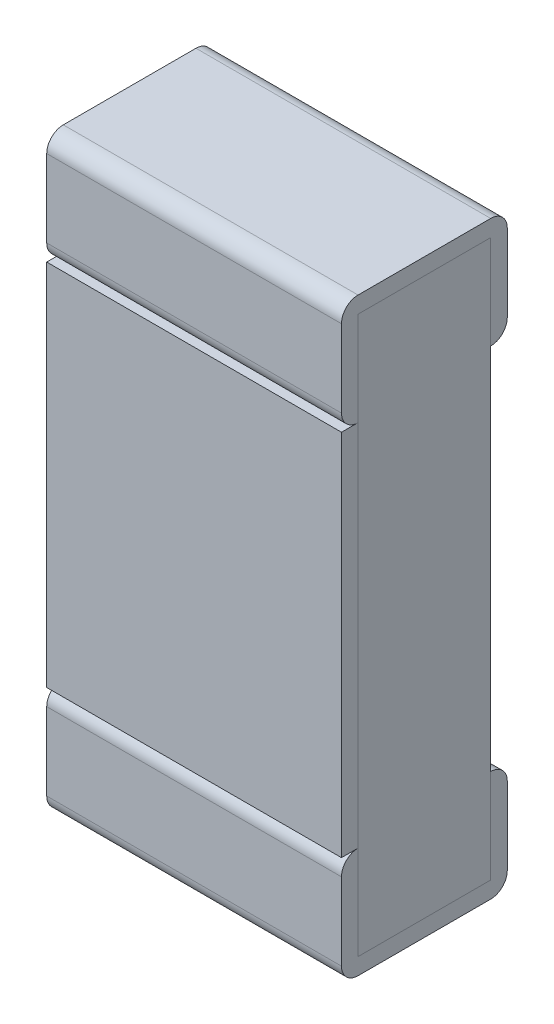
ISO-10303-21;
HEADER;
FILE_DESCRIPTION(('STEP AP214'),'2;1');
FILE_NAME('part.step','',(''),(''),'','','');
FILE_SCHEMA(('AUTOMOTIVE_DESIGN { 1 0 10303 214 1 1 1 1 }'));
ENDSEC;
DATA;
#1=APPLICATION_CONTEXT('core data for automotive mechanical design processes');
#2=APPLICATION_PROTOCOL_DEFINITION('international standard','automotive_design',2000,#1);
#3=PRODUCT_CONTEXT('',#1,'mechanical');
#4=PRODUCT('Part','Part','',(#3));
#5=PRODUCT_RELATED_PRODUCT_CATEGORY('part','',(#4));
#6=PRODUCT_DEFINITION_FORMATION('','',#4);
#7=PRODUCT_DEFINITION_CONTEXT('part definition',#1,'design');
#8=PRODUCT_DEFINITION('design','',#6,#7);
#9=PRODUCT_DEFINITION_SHAPE('','',#8);
#10=(LENGTH_UNIT() NAMED_UNIT(*) SI_UNIT(.MILLI.,.METRE.));
#11=(NAMED_UNIT(*) PLANE_ANGLE_UNIT() SI_UNIT($,.RADIAN.));
#12=(NAMED_UNIT(*) SI_UNIT($,.STERADIAN.) SOLID_ANGLE_UNIT());
#13=UNCERTAINTY_MEASURE_WITH_UNIT(LENGTH_MEASURE(1.E-05),#10,'distance_accuracy_value','');
#14=(GEOMETRIC_REPRESENTATION_CONTEXT(3) GLOBAL_UNCERTAINTY_ASSIGNED_CONTEXT((#13)) GLOBAL_UNIT_ASSIGNED_CONTEXT((#10,
#11,#12)) REPRESENTATION_CONTEXT('',''));
#15=CARTESIAN_POINT('',(0.,0.,0.));
#16=DIRECTION('',(0.,0.,1.));
#17=DIRECTION('',(1.,0.,0.));
#18=AXIS2_PLACEMENT_3D('',#15,#16,#17);
#19=CARTESIAN_POINT('',(182.443744279938,109.49429329235,112.661582908599));
#20=DIRECTION('',(0.,0.,1.));
#21=DIRECTION('',(1.,0.,0.));
#22=AXIS2_PLACEMENT_3D('',#19,#20,#21);
#23=PLANE('',#22);
#24=DIRECTION('',(1.,0.,0.));
#25=VECTOR('',#24,1.);
#26=CARTESIAN_POINT('',(182.443744279938,109.49429329235,112.661582908599));
#27=LINE('',#26,#25);
#28=CARTESIAN_POINT('',(182.443744279938,109.49429329235,112.661582908599));
#29=VERTEX_POINT('',#28);
#30=CARTESIAN_POINT('',(183.243744279938,109.49429329235,112.661582908599));
#31=VERTEX_POINT('',#30);
#32=EDGE_CURVE('E67',#29,#31,#27,.T.);
#33=ORIENTED_EDGE('',*,*,#32,.F.);
#34=DIRECTION('',(0.,-1.,0.));
#35=VECTOR('',#34,1.);
#36=CARTESIAN_POINT('',(182.443744279938,109.49429329235,112.661582908599));
#37=LINE('',#36,#35);
#38=CARTESIAN_POINT('',(182.443744279938,108.49429329235,112.661582908599));
#39=VERTEX_POINT('',#38);
#40=EDGE_CURVE('E11',#29,#39,#37,.T.);
#41=ORIENTED_EDGE('',*,*,#40,.T.);
#42=DIRECTION('',(1.,0.,0.));
#43=VECTOR('',#42,1.);
#44=CARTESIAN_POINT('',(182.443744279938,108.49429329235,112.661582908599));
#45=LINE('',#44,#43);
#46=CARTESIAN_POINT('',(183.243744279938,108.49429329235,112.661582908599));
#47=VERTEX_POINT('',#46);
#48=EDGE_CURVE('E55',#39,#47,#45,.T.);
#49=ORIENTED_EDGE('',*,*,#48,.T.);
#50=DIRECTION('',(0.,-1.,0.));
#51=VECTOR('',#50,1.);
#52=CARTESIAN_POINT('',(183.243744279938,109.49429329235,112.661582908599));
#53=LINE('',#52,#51);
#54=EDGE_CURVE('E265',#31,#47,#53,.T.);
#55=ORIENTED_EDGE('',*,*,#54,.F.);
#56=EDGE_LOOP('',(#33,#41,#49,#55));
#57=FACE_BOUND('',#56,.T.);
#58=ADVANCED_FACE('F44',(#57),#23,.T.);
#59=CARTESIAN_POINT('',(182.443744279938,108.49429329235,112.616582908599));
#60=DIRECTION('',(0.,-1.,0.));
#61=DIRECTION('',(0.,0.,-1.));
#62=AXIS2_PLACEMENT_3D('',#59,#60,#61);
#63=PLANE('',#62);
#64=DIRECTION('',(0.,0.,1.));
#65=VECTOR('',#64,1.);
#66=CARTESIAN_POINT('',(182.443744279938,108.49429329235,112.616582908599));
#67=LINE('',#66,#65);
#68=CARTESIAN_POINT('',(182.443744279938,108.49429329235,112.616582908599));
#69=VERTEX_POINT('',#68);
#70=EDGE_CURVE('E298',#69,#39,#67,.T.);
#71=ORIENTED_EDGE('',*,*,#70,.F.);
#72=DIRECTION('',(1.,0.,0.));
#73=VECTOR('',#72,1.);
#74=CARTESIAN_POINT('',(182.443744279938,108.49429329235,112.616582908599));
#75=LINE('',#74,#73);
#76=CARTESIAN_POINT('',(183.243744279938,108.49429329235,112.616582908599));
#77=VERTEX_POINT('',#76);
#78=EDGE_CURVE('E257',#69,#77,#75,.T.);
#79=ORIENTED_EDGE('',*,*,#78,.T.);
#80=DIRECTION('',(0.,0.,1.));
#81=VECTOR('',#80,1.);
#82=CARTESIAN_POINT('',(183.243744279938,108.49429329235,112.616582908599));
#83=LINE('',#82,#81);
#84=EDGE_CURVE('E351',#77,#47,#83,.T.);
#85=ORIENTED_EDGE('',*,*,#84,.T.);
#86=ORIENTED_EDGE('',*,*,#48,.F.);
#87=EDGE_LOOP('',(#71,#79,#85,#86));
#88=FACE_BOUND('',#87,.T.);
#89=ADVANCED_FACE('F468',(#88),#63,.T.);
#90=CARTESIAN_POINT('',(182.443744279938,108.44929329235,112.616582908599));
#91=DIRECTION('',(1.,0.,0.));
#92=DIRECTION('',(0.,1.,0.));
#93=AXIS2_PLACEMENT_3D('',#90,#91,#92);
#94=CYLINDRICAL_SURFACE('',#93,0.0450000000000034);
#95=CARTESIAN_POINT('',(182.443744279938,108.44929329235,112.616582908599));
#96=DIRECTION('',(1.,0.,0.));
#97=DIRECTION('',(0.,0.,1.));
#98=AXIS2_PLACEMENT_3D('',#95,#96,#97);
#99=CIRCLE('',#98,0.0450000000000034);
#100=CARTESIAN_POINT('',(182.443744279938,108.44929329235,112.661582908599));
#101=VERTEX_POINT('',#100);
#102=EDGE_CURVE('E347',#69,#101,#99,.T.);
#103=ORIENTED_EDGE('',*,*,#102,.T.);
#104=DIRECTION('',(1.,0.,0.));
#105=VECTOR('',#104,1.);
#106=CARTESIAN_POINT('',(182.443744279938,108.44929329235,112.661582908599));
#107=LINE('',#106,#105);
#108=CARTESIAN_POINT('',(183.243744279938,108.44929329235,112.661582908599));
#109=VERTEX_POINT('',#108);
#110=EDGE_CURVE('E352',#101,#109,#107,.T.);
#111=ORIENTED_EDGE('',*,*,#110,.T.);
#112=CARTESIAN_POINT('',(183.243744279938,108.44929329235,112.616582908599));
#113=DIRECTION('',(1.,0.,0.));
#114=DIRECTION('',(0.,0.,1.));
#115=AXIS2_PLACEMENT_3D('',#112,#113,#114);
#116=CIRCLE('',#115,0.0450000000000034);
#117=EDGE_CURVE('E212',#77,#109,#116,.T.);
#118=ORIENTED_EDGE('',*,*,#117,.F.);
#119=ORIENTED_EDGE('',*,*,#78,.F.);
#120=EDGE_LOOP('',(#103,#111,#118,#119));
#121=FACE_BOUND('',#120,.T.);
#122=ADVANCED_FACE('F462',(#121),#94,.T.);
#123=CARTESIAN_POINT('',(182.443744279938,108.49429329235,112.661582908599));
#124=DIRECTION('',(0.,0.,1.));
#125=DIRECTION('',(1.,0.,0.));
#126=AXIS2_PLACEMENT_3D('',#123,#124,#125);
#127=PLANE('',#126);
#128=DIRECTION('',(0.,-1.,0.));
#129=VECTOR('',#128,1.);
#130=CARTESIAN_POINT('',(183.243744279938,108.49429329235,112.661582908599));
#131=LINE('',#130,#129);
#132=CARTESIAN_POINT('',(183.243744279938,108.23929329235,112.661582908599));
#133=VERTEX_POINT('',#132);
#134=EDGE_CURVE('E175',#109,#133,#131,.T.);
#135=ORIENTED_EDGE('',*,*,#134,.F.);
#136=ORIENTED_EDGE('',*,*,#110,.F.);
#137=DIRECTION('',(0.,-1.,0.));
#138=VECTOR('',#137,1.);
#139=CARTESIAN_POINT('',(182.443744279938,108.49429329235,112.661582908599));
#140=LINE('',#139,#138);
#141=CARTESIAN_POINT('',(182.443744279938,108.23929329235,112.661582908599));
#142=VERTEX_POINT('',#141);
#143=EDGE_CURVE('E336',#101,#142,#140,.T.);
#144=ORIENTED_EDGE('',*,*,#143,.T.);
#145=DIRECTION('',(1.,0.,0.));
#146=VECTOR('',#145,1.);
#147=CARTESIAN_POINT('',(182.443744279938,108.23929329235,112.661582908599));
#148=LINE('',#147,#146);
#149=EDGE_CURVE('E191',#142,#133,#148,.T.);
#150=ORIENTED_EDGE('',*,*,#149,.T.);
#151=EDGE_LOOP('',(#135,#136,#144,#150));
#152=FACE_BOUND('',#151,.T.);
#153=ADVANCED_FACE('F46',(#152),#127,.T.);
#154=CARTESIAN_POINT('',(182.443744279938,108.23929329235,112.616582908599));
#155=DIRECTION('',(1.,0.,0.));
#156=DIRECTION('',(0.,-1.,0.));
#157=AXIS2_PLACEMENT_3D('',#154,#155,#156);
#158=CYLINDRICAL_SURFACE('',#157,0.0450000000000034);
#159=DIRECTION('',(1.,0.,0.));
#160=VECTOR('',#159,1.);
#161=CARTESIAN_POINT('',(182.443744279938,108.19429329235,112.616582908599));
#162=LINE('',#161,#160);
#163=CARTESIAN_POINT('',(182.443744279938,108.19429329235,112.616582908599));
#164=VERTEX_POINT('',#163);
#165=CARTESIAN_POINT('',(183.243744279938,108.19429329235,112.616582908599));
#166=VERTEX_POINT('',#165);
#167=EDGE_CURVE('E180',#164,#166,#162,.T.);
#168=ORIENTED_EDGE('',*,*,#167,.T.);
#169=CARTESIAN_POINT('',(183.243744279938,108.23929329235,112.616582908599));
#170=DIRECTION('',(-1.,0.,0.));
#171=DIRECTION('',(0.,0.,1.));
#172=AXIS2_PLACEMENT_3D('',#169,#170,#171);
#173=CIRCLE('',#172,0.0450000000000034);
#174=EDGE_CURVE('E165',#166,#133,#173,.T.);
#175=ORIENTED_EDGE('',*,*,#174,.T.);
#176=ORIENTED_EDGE('',*,*,#149,.F.);
#177=CARTESIAN_POINT('',(182.443744279938,108.23929329235,112.616582908599));
#178=DIRECTION('',(-1.,0.,0.));
#179=DIRECTION('',(0.,0.,1.));
#180=AXIS2_PLACEMENT_3D('',#177,#178,#179);
#181=CIRCLE('',#180,0.0450000000000034);
#182=EDGE_CURVE('E186',#164,#142,#181,.T.);
#183=ORIENTED_EDGE('',*,*,#182,.F.);
#184=EDGE_LOOP('',(#168,#175,#176,#183));
#185=FACE_BOUND('',#184,.T.);
#186=ADVANCED_FACE('F184',(#185),#158,.T.);
#187=CARTESIAN_POINT('',(182.443744279938,108.19429329235,112.211582908599));
#188=DIRECTION('',(0.,-1.,0.));
#189=DIRECTION('',(0.,0.,-1.));
#190=AXIS2_PLACEMENT_3D('',#187,#188,#189);
#191=PLANE('',#190);
#192=DIRECTION('',(0.,0.,1.));
#193=VECTOR('',#192,1.);
#194=CARTESIAN_POINT('',(182.443744279938,108.19429329235,112.211582908599));
#195=LINE('',#194,#193);
#196=CARTESIAN_POINT('',(182.443744279938,108.19429329235,112.256582908599));
#197=VERTEX_POINT('',#196);
#198=EDGE_CURVE('E286',#197,#164,#195,.T.);
#199=ORIENTED_EDGE('',*,*,#198,.F.);
#200=DIRECTION('',(1.,0.,0.));
#201=VECTOR('',#200,1.);
#202=CARTESIAN_POINT('',(182.443744279938,108.19429329235,112.256582908599));
#203=LINE('',#202,#201);
#204=CARTESIAN_POINT('',(183.243744279938,108.19429329235,112.256582908599));
#205=VERTEX_POINT('',#204);
#206=EDGE_CURVE('E181',#197,#205,#203,.T.);
#207=ORIENTED_EDGE('',*,*,#206,.T.);
#208=DIRECTION('',(0.,0.,1.));
#209=VECTOR('',#208,1.);
#210=CARTESIAN_POINT('',(183.243744279938,108.19429329235,112.211582908599));
#211=LINE('',#210,#209);
#212=EDGE_CURVE('E171',#205,#166,#211,.T.);
#213=ORIENTED_EDGE('',*,*,#212,.T.);
#214=ORIENTED_EDGE('',*,*,#167,.F.);
#215=EDGE_LOOP('',(#199,#207,#213,#214));
#216=FACE_BOUND('',#215,.T.);
#217=ADVANCED_FACE('F193',(#216),#191,.T.);
#218=CARTESIAN_POINT('',(182.443744279938,108.23929329235,112.256582908599));
#219=DIRECTION('',(1.,0.,0.));
#220=DIRECTION('',(0.,-1.,0.));
#221=AXIS2_PLACEMENT_3D('',#218,#219,#220);
#222=CYLINDRICAL_SURFACE('',#221,0.0450000000000034);
#223=CARTESIAN_POINT('',(182.443744279938,108.23929329235,112.256582908599));
#224=DIRECTION('',(1.,0.,0.));
#225=DIRECTION('',(0.,0.,1.));
#226=AXIS2_PLACEMENT_3D('',#223,#224,#225);
#227=CIRCLE('',#226,0.0450000000000034);
#228=CARTESIAN_POINT('',(182.443744279938,108.23929329235,112.211582908599));
#229=VERTEX_POINT('',#228);
#230=EDGE_CURVE('E197',#197,#229,#227,.T.);
#231=ORIENTED_EDGE('',*,*,#230,.T.);
#232=DIRECTION('',(1.,0.,0.));
#233=VECTOR('',#232,1.);
#234=CARTESIAN_POINT('',(182.443744279938,108.23929329235,112.211582908599));
#235=LINE('',#234,#233);
#236=CARTESIAN_POINT('',(183.243744279938,108.23929329235,112.211582908599));
#237=VERTEX_POINT('',#236);
#238=EDGE_CURVE('E206',#229,#237,#235,.T.);
#239=ORIENTED_EDGE('',*,*,#238,.T.);
#240=CARTESIAN_POINT('',(183.243744279938,108.23929329235,112.256582908599));
#241=DIRECTION('',(1.,0.,0.));
#242=DIRECTION('',(0.,0.,1.));
#243=AXIS2_PLACEMENT_3D('',#240,#241,#242);
#244=CIRCLE('',#243,0.0450000000000034);
#245=EDGE_CURVE('E292',#205,#237,#244,.T.);
#246=ORIENTED_EDGE('',*,*,#245,.F.);
#247=ORIENTED_EDGE('',*,*,#206,.F.);
#248=EDGE_LOOP('',(#231,#239,#246,#247));
#249=FACE_BOUND('',#248,.T.);
#250=ADVANCED_FACE('F372',(#249),#222,.T.);
#251=CARTESIAN_POINT('',(182.443744279938,108.49429329235,112.211582908599));
#252=DIRECTION('',(0.,0.,1.));
#253=DIRECTION('',(1.,0.,0.));
#254=AXIS2_PLACEMENT_3D('',#251,#252,#253);
#255=PLANE('',#254);
#256=ORIENTED_EDGE('',*,*,#238,.F.);
#257=DIRECTION('',(0.,-1.,0.));
#258=VECTOR('',#257,1.);
#259=CARTESIAN_POINT('',(182.443744279938,108.49429329235,112.211582908599));
#260=LINE('',#259,#258);
#261=CARTESIAN_POINT('',(182.443744279938,108.44929329235,112.211582908599));
#262=VERTEX_POINT('',#261);
#263=EDGE_CURVE('E303',#262,#229,#260,.T.);
#264=ORIENTED_EDGE('',*,*,#263,.F.);
#265=DIRECTION('',(1.,0.,0.));
#266=VECTOR('',#265,1.);
#267=CARTESIAN_POINT('',(182.443744279938,108.44929329235,112.211582908599));
#268=LINE('',#267,#266);
#269=CARTESIAN_POINT('',(183.243744279938,108.44929329235,112.211582908599));
#270=VERTEX_POINT('',#269);
#271=EDGE_CURVE('E266',#262,#270,#268,.T.);
#272=ORIENTED_EDGE('',*,*,#271,.T.);
#273=DIRECTION('',(0.,-1.,0.));
#274=VECTOR('',#273,1.);
#275=CARTESIAN_POINT('',(183.243744279938,108.49429329235,112.211582908599));
#276=LINE('',#275,#274);
#277=EDGE_CURVE('E270',#270,#237,#276,.T.);
#278=ORIENTED_EDGE('',*,*,#277,.T.);
#279=EDGE_LOOP('',(#256,#264,#272,#278));
#280=FACE_BOUND('',#279,.T.);
#281=ADVANCED_FACE('F626',(#280),#255,.F.);
#282=CARTESIAN_POINT('',(182.443744279938,108.44929329235,112.256582908599));
#283=DIRECTION('',(1.,0.,0.));
#284=DIRECTION('',(0.,1.,0.));
#285=AXIS2_PLACEMENT_3D('',#282,#283,#284);
#286=CYLINDRICAL_SURFACE('',#285,0.0450000000000034);
#287=DIRECTION('',(1.,0.,0.));
#288=VECTOR('',#287,1.);
#289=CARTESIAN_POINT('',(182.443744279938,108.49429329235,112.256582908599));
#290=LINE('',#289,#288);
#291=CARTESIAN_POINT('',(182.443744279938,108.49429329235,112.256582908599));
#292=VERTEX_POINT('',#291);
#293=CARTESIAN_POINT('',(183.243744279938,108.49429329235,112.256582908599));
#294=VERTEX_POINT('',#293);
#295=EDGE_CURVE('E219',#292,#294,#290,.T.);
#296=ORIENTED_EDGE('',*,*,#295,.T.);
#297=CARTESIAN_POINT('',(183.243744279938,108.44929329235,112.256582908599));
#298=DIRECTION('',(-1.,0.,0.));
#299=DIRECTION('',(0.,0.,1.));
#300=AXIS2_PLACEMENT_3D('',#297,#298,#299);
#301=CIRCLE('',#300,0.0450000000000034);
#302=EDGE_CURVE('E215',#294,#270,#301,.T.);
#303=ORIENTED_EDGE('',*,*,#302,.T.);
#304=ORIENTED_EDGE('',*,*,#271,.F.);
#305=CARTESIAN_POINT('',(182.443744279938,108.44929329235,112.256582908599));
#306=DIRECTION('',(-1.,0.,0.));
#307=DIRECTION('',(0.,0.,1.));
#308=AXIS2_PLACEMENT_3D('',#305,#306,#307);
#309=CIRCLE('',#308,0.0450000000000034);
#310=EDGE_CURVE('E48',#292,#262,#309,.T.);
#311=ORIENTED_EDGE('',*,*,#310,.F.);
#312=EDGE_LOOP('',(#296,#303,#304,#311));
#313=FACE_BOUND('',#312,.T.);
#314=ADVANCED_FACE('F581',(#313),#286,.T.);
#315=CARTESIAN_POINT('',(183.243744279938,109.49429329235,112.616582908599));
#316=DIRECTION('',(1.,0.,0.));
#317=DIRECTION('',(0.,0.,1.));
#318=AXIS2_PLACEMENT_3D('',#315,#316,#317);
#319=PLANE('',#318);
#320=DIRECTION('',(0.,-1.,0.));
#321=VECTOR('',#320,1.);
#322=CARTESIAN_POINT('',(183.243744279938,109.49429329235,112.616582908599));
#323=LINE('',#322,#321);
#324=CARTESIAN_POINT('',(183.243744279938,109.49429329235,112.616582908599));
#325=VERTEX_POINT('',#324);
#326=EDGE_CURVE('E258',#325,#77,#323,.T.);
#327=ORIENTED_EDGE('',*,*,#326,.F.);
#328=DIRECTION('',(0.,0.,1.));
#329=VECTOR('',#328,1.);
#330=CARTESIAN_POINT('',(183.243744279938,109.49429329235,112.616582908599));
#331=LINE('',#330,#329);
#332=EDGE_CURVE('E220',#325,#31,#331,.T.);
#333=ORIENTED_EDGE('',*,*,#332,.T.);
#334=ORIENTED_EDGE('',*,*,#54,.T.);
#335=ORIENTED_EDGE('',*,*,#84,.F.);
#336=EDGE_LOOP('',(#327,#333,#334,#335));
#337=FACE_BOUND('',#336,.T.);
#338=ADVANCED_FACE('F465',(#337),#319,.T.);
#339=CARTESIAN_POINT('',(183.243744279938,108.49429329235,112.211582908599));
#340=DIRECTION('',(1.,0.,0.));
#341=DIRECTION('',(0.,0.,1.));
#342=AXIS2_PLACEMENT_3D('',#339,#340,#341);
#343=PLANE('',#342);
#344=ORIENTED_EDGE('',*,*,#277,.F.);
#345=ORIENTED_EDGE('',*,*,#302,.F.);
#346=DIRECTION('',(0.,-1.,0.));
#347=VECTOR('',#346,1.);
#348=CARTESIAN_POINT('',(183.243744279938,109.74929329235,112.256582908599));
#349=LINE('',#348,#347);
#350=CARTESIAN_POINT('',(183.243744279938,108.23929329235,112.256582908599));
#351=VERTEX_POINT('',#350);
#352=EDGE_CURVE('E288',#294,#351,#349,.T.);
#353=ORIENTED_EDGE('',*,*,#352,.T.);
#354=DIRECTION('',(0.,0.,1.));
#355=VECTOR('',#354,1.);
#356=CARTESIAN_POINT('',(183.243744279938,108.23929329235,112.256582908599));
#357=LINE('',#356,#355);
#358=CARTESIAN_POINT('',(183.243744279938,108.23929329235,112.616582908599));
#359=VERTEX_POINT('',#358);
#360=EDGE_CURVE('E214',#351,#359,#357,.T.);
#361=ORIENTED_EDGE('',*,*,#360,.T.);
#362=DIRECTION('',(0.,-1.,0.));
#363=VECTOR('',#362,1.);
#364=CARTESIAN_POINT('',(183.243744279938,109.74929329235,112.616582908599));
#365=LINE('',#364,#363);
#366=EDGE_CURVE('E225',#77,#359,#365,.T.);
#367=ORIENTED_EDGE('',*,*,#366,.F.);
#368=ORIENTED_EDGE('',*,*,#117,.T.);
#369=ORIENTED_EDGE('',*,*,#134,.T.);
#370=ORIENTED_EDGE('',*,*,#174,.F.);
#371=ORIENTED_EDGE('',*,*,#212,.F.);
#372=ORIENTED_EDGE('',*,*,#245,.T.);
#373=EDGE_LOOP('',(#344,#345,#353,#361,#367,#368,#369,#370,#371,#372));
#374=FACE_BOUND('',#373,.T.);
#375=ADVANCED_FACE('F168',(#374),#343,.T.);
#376=CARTESIAN_POINT('',(182.443744279938,109.49429329235,112.616582908599));
#377=DIRECTION('',(0.,-1.,0.));
#378=DIRECTION('',(0.,0.,-1.));
#379=AXIS2_PLACEMENT_3D('',#376,#377,#378);
#380=PLANE('',#379);
#381=ORIENTED_EDGE('',*,*,#32,.T.);
#382=ORIENTED_EDGE('',*,*,#332,.F.);
#383=DIRECTION('',(1.,0.,0.));
#384=VECTOR('',#383,1.);
#385=CARTESIAN_POINT('',(182.443744279938,109.49429329235,112.616582908599));
#386=LINE('',#385,#384);
#387=CARTESIAN_POINT('',(182.443744279938,109.49429329235,112.616582908599));
#388=VERTEX_POINT('',#387);
#389=EDGE_CURVE('E221',#388,#325,#386,.T.);
#390=ORIENTED_EDGE('',*,*,#389,.F.);
#391=DIRECTION('',(0.,0.,1.));
#392=VECTOR('',#391,1.);
#393=CARTESIAN_POINT('',(182.443744279938,109.49429329235,112.616582908599));
#394=LINE('',#393,#392);
#395=EDGE_CURVE('E293',#388,#29,#394,.T.);
#396=ORIENTED_EDGE('',*,*,#395,.T.);
#397=EDGE_LOOP('',(#381,#382,#390,#396));
#398=FACE_BOUND('',#397,.T.);
#399=ADVANCED_FACE('F572',(#398),#380,.F.);
#400=CARTESIAN_POINT('',(182.443744279938,109.49429329235,112.616582908599));
#401=DIRECTION('',(1.,0.,0.));
#402=DIRECTION('',(0.,0.,1.));
#403=AXIS2_PLACEMENT_3D('',#400,#401,#402);
#404=PLANE('',#403);
#405=ORIENTED_EDGE('',*,*,#70,.T.);
#406=ORIENTED_EDGE('',*,*,#40,.F.);
#407=ORIENTED_EDGE('',*,*,#395,.F.);
#408=DIRECTION('',(0.,-1.,0.));
#409=VECTOR('',#408,1.);
#410=CARTESIAN_POINT('',(182.443744279938,109.49429329235,112.616582908599));
#411=LINE('',#410,#409);
#412=EDGE_CURVE('E325',#388,#69,#411,.T.);
#413=ORIENTED_EDGE('',*,*,#412,.T.);
#414=EDGE_LOOP('',(#405,#406,#407,#413));
#415=FACE_BOUND('',#414,.T.);
#416=ADVANCED_FACE('F577',(#415),#404,.F.);
#417=CARTESIAN_POINT('',(182.443744279938,108.49429329235,112.211582908599));
#418=DIRECTION('',(1.,0.,0.));
#419=DIRECTION('',(0.,0.,1.));
#420=AXIS2_PLACEMENT_3D('',#417,#418,#419);
#421=PLANE('',#420);
#422=ORIENTED_EDGE('',*,*,#230,.F.);
#423=ORIENTED_EDGE('',*,*,#198,.T.);
#424=ORIENTED_EDGE('',*,*,#182,.T.);
#425=ORIENTED_EDGE('',*,*,#143,.F.);
#426=ORIENTED_EDGE('',*,*,#102,.F.);
#427=DIRECTION('',(0.,-1.,0.));
#428=VECTOR('',#427,1.);
#429=CARTESIAN_POINT('',(182.443744279938,109.74929329235,112.616582908599));
#430=LINE('',#429,#428);
#431=CARTESIAN_POINT('',(182.443744279938,108.23929329235,112.616582908599));
#432=VERTEX_POINT('',#431);
#433=EDGE_CURVE('E287',#69,#432,#430,.T.);
#434=ORIENTED_EDGE('',*,*,#433,.T.);
#435=DIRECTION('',(0.,0.,1.));
#436=VECTOR('',#435,1.);
#437=CARTESIAN_POINT('',(182.443744279938,108.23929329235,112.256582908599));
#438=LINE('',#437,#436);
#439=CARTESIAN_POINT('',(182.443744279938,108.23929329235,112.256582908599));
#440=VERTEX_POINT('',#439);
#441=EDGE_CURVE('E253',#440,#432,#438,.T.);
#442=ORIENTED_EDGE('',*,*,#441,.F.);
#443=DIRECTION('',(0.,-1.,0.));
#444=VECTOR('',#443,1.);
#445=CARTESIAN_POINT('',(182.443744279938,109.74929329235,112.256582908599));
#446=LINE('',#445,#444);
#447=EDGE_CURVE('E353',#292,#440,#446,.T.);
#448=ORIENTED_EDGE('',*,*,#447,.F.);
#449=ORIENTED_EDGE('',*,*,#310,.T.);
#450=ORIENTED_EDGE('',*,*,#263,.T.);
#451=EDGE_LOOP('',(#422,#423,#424,#425,#426,#434,#442,#448,#449,#450));
#452=FACE_BOUND('',#451,.T.);
#453=ADVANCED_FACE('F367',(#452),#421,.F.);
#454=CARTESIAN_POINT('',(182.443744279938,109.74929329235,112.256582908599));
#455=DIRECTION('',(0.,0.,1.));
#456=DIRECTION('',(1.,0.,0.));
#457=AXIS2_PLACEMENT_3D('',#454,#455,#456);
#458=PLANE('',#457);
#459=DIRECTION('',(0.,-1.,0.));
#460=VECTOR('',#459,1.);
#461=CARTESIAN_POINT('',(183.243744279938,109.74929329235,112.256582908599));
#462=LINE('',#461,#460);
#463=CARTESIAN_POINT('',(183.243744279938,109.49429329235,112.256582908599));
#464=VERTEX_POINT('',#463);
#465=EDGE_CURVE('E299',#464,#294,#462,.T.);
#466=ORIENTED_EDGE('',*,*,#465,.T.);
#467=ORIENTED_EDGE('',*,*,#295,.F.);
#468=DIRECTION('',(0.,-1.,0.));
#469=VECTOR('',#468,1.);
#470=CARTESIAN_POINT('',(182.443744279938,109.74929329235,112.256582908599));
#471=LINE('',#470,#469);
#472=CARTESIAN_POINT('',(182.443744279938,109.49429329235,112.256582908599));
#473=VERTEX_POINT('',#472);
#474=EDGE_CURVE('E357',#473,#292,#471,.T.);
#475=ORIENTED_EDGE('',*,*,#474,.F.);
#476=DIRECTION('',(1.,0.,0.));
#477=VECTOR('',#476,1.);
#478=CARTESIAN_POINT('',(182.443744279938,109.49429329235,112.256582908599));
#479=LINE('',#478,#477);
#480=EDGE_CURVE('E248',#473,#464,#479,.T.);
#481=ORIENTED_EDGE('',*,*,#480,.T.);
#482=EDGE_LOOP('',(#466,#467,#475,#481));
#483=FACE_BOUND('',#482,.T.);
#484=ADVANCED_FACE('F540',(#483),#458,.F.);
#485=CARTESIAN_POINT('',(183.243744279938,109.74929329235,112.256582908599));
#486=DIRECTION('',(1.,0.,0.));
#487=DIRECTION('',(0.,0.,1.));
#488=AXIS2_PLACEMENT_3D('',#485,#486,#487);
#489=PLANE('',#488);
#490=DIRECTION('',(0.,-1.,0.));
#491=VECTOR('',#490,1.);
#492=CARTESIAN_POINT('',(183.243744279938,109.74929329235,112.256582908599));
#493=LINE('',#492,#491);
#494=CARTESIAN_POINT('',(183.243744279938,109.74929329235,112.256582908599));
#495=VERTEX_POINT('',#494);
#496=EDGE_CURVE('E315',#495,#464,#493,.T.);
#497=ORIENTED_EDGE('',*,*,#496,.F.);
#498=DIRECTION('',(0.,0.,1.));
#499=VECTOR('',#498,1.);
#500=CARTESIAN_POINT('',(183.243744279938,109.74929329235,112.256582908599));
#501=LINE('',#500,#499);
#502=CARTESIAN_POINT('',(183.243744279938,109.74929329235,112.616582908599));
#503=VERTEX_POINT('',#502);
#504=EDGE_CURVE('E244',#495,#503,#501,.T.);
#505=ORIENTED_EDGE('',*,*,#504,.T.);
#506=DIRECTION('',(0.,-1.,0.));
#507=VECTOR('',#506,1.);
#508=CARTESIAN_POINT('',(183.243744279938,109.74929329235,112.616582908599));
#509=LINE('',#508,#507);
#510=EDGE_CURVE('E249',#503,#325,#509,.T.);
#511=ORIENTED_EDGE('',*,*,#510,.T.);
#512=ORIENTED_EDGE('',*,*,#326,.T.);
#513=ORIENTED_EDGE('',*,*,#366,.T.);
#514=ORIENTED_EDGE('',*,*,#360,.F.);
#515=ORIENTED_EDGE('',*,*,#352,.F.);
#516=ORIENTED_EDGE('',*,*,#465,.F.);
#517=EDGE_LOOP('',(#497,#505,#511,#512,#513,#514,#515,#516));
#518=FACE_BOUND('',#517,.T.);
#519=ADVANCED_FACE('F453',(#518),#489,.T.);
#520=CARTESIAN_POINT('',(182.443744279938,109.53929329235,112.616582908599));
#521=DIRECTION('',(1.,0.,0.));
#522=DIRECTION('',(0.,-1.,0.));
#523=AXIS2_PLACEMENT_3D('',#520,#521,#522);
#524=CYLINDRICAL_SURFACE('',#523,0.0450000000000034);
#525=ORIENTED_EDGE('',*,*,#389,.T.);
#526=CARTESIAN_POINT('',(183.243744279938,109.53929329235,112.616582908599));
#527=DIRECTION('',(-1.,0.,0.));
#528=DIRECTION('',(0.,0.,1.));
#529=AXIS2_PLACEMENT_3D('',#526,#527,#528);
#530=CIRCLE('',#529,0.0450000000000034);
#531=CARTESIAN_POINT('',(183.243744279938,109.53929329235,112.661582908599));
#532=VERTEX_POINT('',#531);
#533=EDGE_CURVE('E210',#325,#532,#530,.T.);
#534=ORIENTED_EDGE('',*,*,#533,.T.);
#535=DIRECTION('',(1.,0.,0.));
#536=VECTOR('',#535,1.);
#537=CARTESIAN_POINT('',(182.443744279938,109.53929329235,112.661582908599));
#538=LINE('',#537,#536);
#539=CARTESIAN_POINT('',(182.443744279938,109.53929329235,112.661582908599));
#540=VERTEX_POINT('',#539);
#541=EDGE_CURVE('E243',#540,#532,#538,.T.);
#542=ORIENTED_EDGE('',*,*,#541,.F.);
#543=CARTESIAN_POINT('',(182.443744279938,109.53929329235,112.616582908599));
#544=DIRECTION('',(-1.,0.,0.));
#545=DIRECTION('',(0.,0.,1.));
#546=AXIS2_PLACEMENT_3D('',#543,#544,#545);
#547=CIRCLE('',#546,0.0450000000000034);
#548=EDGE_CURVE('E320',#388,#540,#547,.T.);
#549=ORIENTED_EDGE('',*,*,#548,.F.);
#550=EDGE_LOOP('',(#525,#534,#542,#549));
#551=FACE_BOUND('',#550,.T.);
#552=ADVANCED_FACE('F568',(#551),#524,.T.);
#553=CARTESIAN_POINT('',(182.443744279938,109.79429329235,112.661582908599));
#554=DIRECTION('',(0.,0.,1.));
#555=DIRECTION('',(1.,0.,0.));
#556=AXIS2_PLACEMENT_3D('',#553,#554,#555);
#557=PLANE('',#556);
#558=DIRECTION('',(0.,-1.,0.));
#559=VECTOR('',#558,1.);
#560=CARTESIAN_POINT('',(183.243744279938,109.79429329235,112.661582908599));
#561=LINE('',#560,#559);
#562=CARTESIAN_POINT('',(183.243744279938,109.74929329235,112.661582908599));
#563=VERTEX_POINT('',#562);
#564=EDGE_CURVE('E238',#563,#532,#561,.T.);
#565=ORIENTED_EDGE('',*,*,#564,.F.);
#566=DIRECTION('',(1.,0.,0.));
#567=VECTOR('',#566,1.);
#568=CARTESIAN_POINT('',(182.443744279938,109.74929329235,112.661582908599));
#569=LINE('',#568,#567);
#570=CARTESIAN_POINT('',(182.443744279938,109.74929329235,112.661582908599));
#571=VERTEX_POINT('',#570);
#572=EDGE_CURVE('E339',#571,#563,#569,.T.);
#573=ORIENTED_EDGE('',*,*,#572,.F.);
#574=DIRECTION('',(0.,-1.,0.));
#575=VECTOR('',#574,1.);
#576=CARTESIAN_POINT('',(182.443744279938,109.79429329235,112.661582908599));
#577=LINE('',#576,#575);
#578=EDGE_CURVE('E239',#571,#540,#577,.T.);
#579=ORIENTED_EDGE('',*,*,#578,.T.);
#580=ORIENTED_EDGE('',*,*,#541,.T.);
#581=EDGE_LOOP('',(#565,#573,#579,#580));
#582=FACE_BOUND('',#581,.T.);
#583=ADVANCED_FACE('F561',(#582),#557,.T.);
#584=CARTESIAN_POINT('',(182.443744279938,109.74929329235,112.256582908599));
#585=DIRECTION('',(1.,0.,0.));
#586=DIRECTION('',(0.,0.,1.));
#587=AXIS2_PLACEMENT_3D('',#584,#585,#586);
#588=PLANE('',#587);
#589=ORIENTED_EDGE('',*,*,#474,.T.);
#590=ORIENTED_EDGE('',*,*,#447,.T.);
#591=ORIENTED_EDGE('',*,*,#441,.T.);
#592=ORIENTED_EDGE('',*,*,#433,.F.);
#593=ORIENTED_EDGE('',*,*,#412,.F.);
#594=DIRECTION('',(0.,-1.,0.));
#595=VECTOR('',#594,1.);
#596=CARTESIAN_POINT('',(182.443744279938,109.74929329235,112.616582908599));
#597=LINE('',#596,#595);
#598=CARTESIAN_POINT('',(182.443744279938,109.74929329235,112.616582908599));
#599=VERTEX_POINT('',#598);
#600=EDGE_CURVE('E283',#599,#388,#597,.T.);
#601=ORIENTED_EDGE('',*,*,#600,.F.);
#602=DIRECTION('',(0.,0.,1.));
#603=VECTOR('',#602,1.);
#604=CARTESIAN_POINT('',(182.443744279938,109.74929329235,112.256582908599));
#605=LINE('',#604,#603);
#606=CARTESIAN_POINT('',(182.443744279938,109.74929329235,112.256582908599));
#607=VERTEX_POINT('',#606);
#608=EDGE_CURVE('E278',#607,#599,#605,.T.);
#609=ORIENTED_EDGE('',*,*,#608,.F.);
#610=DIRECTION('',(0.,-1.,0.));
#611=VECTOR('',#610,1.);
#612=CARTESIAN_POINT('',(182.443744279938,109.74929329235,112.256582908599));
#613=LINE('',#612,#611);
#614=EDGE_CURVE('E230',#607,#473,#613,.T.);
#615=ORIENTED_EDGE('',*,*,#614,.T.);
#616=EDGE_LOOP('',(#589,#590,#591,#592,#593,#601,#609,#615));
#617=FACE_BOUND('',#616,.T.);
#618=ADVANCED_FACE('F575',(#617),#588,.F.);
#619=CARTESIAN_POINT('',(182.443744279938,109.53929329235,112.256582908599));
#620=DIRECTION('',(1.,0.,0.));
#621=DIRECTION('',(0.,-1.,0.));
#622=AXIS2_PLACEMENT_3D('',#619,#620,#621);
#623=CYLINDRICAL_SURFACE('',#622,0.0450000000000034);
#624=CARTESIAN_POINT('',(182.443744279938,109.53929329235,112.256582908599));
#625=DIRECTION('',(1.,0.,0.));
#626=DIRECTION('',(0.,0.,1.));
#627=AXIS2_PLACEMENT_3D('',#624,#625,#626);
#628=CIRCLE('',#627,0.0450000000000034);
#629=CARTESIAN_POINT('',(182.443744279938,109.53929329235,112.211582908599));
#630=VERTEX_POINT('',#629);
#631=EDGE_CURVE('E226',#473,#630,#628,.T.);
#632=ORIENTED_EDGE('',*,*,#631,.T.);
#633=DIRECTION('',(1.,0.,0.));
#634=VECTOR('',#633,1.);
#635=CARTESIAN_POINT('',(182.443744279938,109.53929329235,112.211582908599));
#636=LINE('',#635,#634);
#637=CARTESIAN_POINT('',(183.243744279938,109.53929329235,112.211582908599));
#638=VERTEX_POINT('',#637);
#639=EDGE_CURVE('E231',#630,#638,#636,.T.);
#640=ORIENTED_EDGE('',*,*,#639,.T.);
#641=CARTESIAN_POINT('',(183.243744279938,109.53929329235,112.256582908599));
#642=DIRECTION('',(1.,0.,0.));
#643=DIRECTION('',(0.,0.,1.));
#644=AXIS2_PLACEMENT_3D('',#641,#642,#643);
#645=CIRCLE('',#644,0.0450000000000034);
#646=EDGE_CURVE('E329',#464,#638,#645,.T.);
#647=ORIENTED_EDGE('',*,*,#646,.F.);
#648=ORIENTED_EDGE('',*,*,#480,.F.);
#649=EDGE_LOOP('',(#632,#640,#647,#648));
#650=FACE_BOUND('',#649,.T.);
#651=ADVANCED_FACE('F543',(#650),#623,.T.);
#652=CARTESIAN_POINT('',(182.443744279938,109.79429329235,112.211582908599));
#653=DIRECTION('',(0.,0.,1.));
#654=DIRECTION('',(1.,0.,0.));
#655=AXIS2_PLACEMENT_3D('',#652,#653,#654);
#656=PLANE('',#655);
#657=ORIENTED_EDGE('',*,*,#639,.F.);
#658=DIRECTION('',(0.,-1.,0.));
#659=VECTOR('',#658,1.);
#660=CARTESIAN_POINT('',(182.443744279938,109.79429329235,112.211582908599));
#661=LINE('',#660,#659);
#662=CARTESIAN_POINT('',(182.443744279938,109.74929329235,112.211582908599));
#663=VERTEX_POINT('',#662);
#664=EDGE_CURVE('E321',#663,#630,#661,.T.);
#665=ORIENTED_EDGE('',*,*,#664,.F.);
#666=DIRECTION('',(1.,0.,0.));
#667=VECTOR('',#666,1.);
#668=CARTESIAN_POINT('',(182.443744279938,109.74929329235,112.211582908599));
#669=LINE('',#668,#667);
#670=CARTESIAN_POINT('',(183.243744279938,109.74929329235,112.211582908599));
#671=VERTEX_POINT('',#670);
#672=EDGE_CURVE('E271',#663,#671,#669,.T.);
#673=ORIENTED_EDGE('',*,*,#672,.T.);
#674=DIRECTION('',(0.,-1.,0.));
#675=VECTOR('',#674,1.);
#676=CARTESIAN_POINT('',(183.243744279938,109.79429329235,112.211582908599));
#677=LINE('',#676,#675);
#678=EDGE_CURVE('E235',#671,#638,#677,.T.);
#679=ORIENTED_EDGE('',*,*,#678,.T.);
#680=EDGE_LOOP('',(#657,#665,#673,#679));
#681=FACE_BOUND('',#680,.T.);
#682=ADVANCED_FACE('F545',(#681),#656,.F.);
#683=CARTESIAN_POINT('',(183.243744279938,109.79429329235,112.211582908599));
#684=DIRECTION('',(1.,0.,0.));
#685=DIRECTION('',(0.,0.,1.));
#686=AXIS2_PLACEMENT_3D('',#683,#684,#685);
#687=PLANE('',#686);
#688=ORIENTED_EDGE('',*,*,#678,.F.);
#689=CARTESIAN_POINT('',(183.243744279938,109.74929329235,112.256582908599));
#690=DIRECTION('',(-1.,0.,0.));
#691=DIRECTION('',(0.,0.,1.));
#692=AXIS2_PLACEMENT_3D('',#689,#690,#691);
#693=CIRCLE('',#692,0.0450000000000034);
#694=CARTESIAN_POINT('',(183.243744279938,109.79429329235,112.256582908599));
#695=VERTEX_POINT('',#694);
#696=EDGE_CURVE('E282',#695,#671,#693,.T.);
#697=ORIENTED_EDGE('',*,*,#696,.F.);
#698=DIRECTION('',(0.,0.,1.));
#699=VECTOR('',#698,1.);
#700=CARTESIAN_POINT('',(183.243744279938,109.79429329235,112.211582908599));
#701=LINE('',#700,#699);
#702=CARTESIAN_POINT('',(183.243744279938,109.79429329235,112.616582908599));
#703=VERTEX_POINT('',#702);
#704=EDGE_CURVE('E232',#695,#703,#701,.T.);
#705=ORIENTED_EDGE('',*,*,#704,.T.);
#706=CARTESIAN_POINT('',(183.243744279938,109.74929329235,112.616582908599));
#707=DIRECTION('',(1.,0.,0.));
#708=DIRECTION('',(0.,0.,1.));
#709=AXIS2_PLACEMENT_3D('',#706,#707,#708);
#710=CIRCLE('',#709,0.0450000000000034);
#711=EDGE_CURVE('E127',#703,#563,#710,.T.);
#712=ORIENTED_EDGE('',*,*,#711,.T.);
#713=ORIENTED_EDGE('',*,*,#564,.T.);
#714=ORIENTED_EDGE('',*,*,#533,.F.);
#715=ORIENTED_EDGE('',*,*,#510,.F.);
#716=ORIENTED_EDGE('',*,*,#504,.F.);
#717=ORIENTED_EDGE('',*,*,#496,.T.);
#718=ORIENTED_EDGE('',*,*,#646,.T.);
#719=EDGE_LOOP('',(#688,#697,#705,#712,#713,#714,#715,#716,#717,#718));
#720=FACE_BOUND('',#719,.T.);
#721=ADVANCED_FACE('F533',(#720),#687,.T.);
#722=CARTESIAN_POINT('',(182.443744279938,109.74929329235,112.616582908599));
#723=DIRECTION('',(1.,0.,0.));
#724=DIRECTION('',(0.,1.,0.));
#725=AXIS2_PLACEMENT_3D('',#722,#723,#724);
#726=CYLINDRICAL_SURFACE('',#725,0.0450000000000034);
#727=CARTESIAN_POINT('',(182.443744279938,109.74929329235,112.616582908599));
#728=DIRECTION('',(1.,0.,0.));
#729=DIRECTION('',(0.,0.,1.));
#730=AXIS2_PLACEMENT_3D('',#727,#728,#729);
#731=CIRCLE('',#730,0.0450000000000034);
#732=CARTESIAN_POINT('',(182.443744279938,109.79429329235,112.616582908599));
#733=VERTEX_POINT('',#732);
#734=EDGE_CURVE('E332',#733,#571,#731,.T.);
#735=ORIENTED_EDGE('',*,*,#734,.T.);
#736=ORIENTED_EDGE('',*,*,#572,.T.);
#737=ORIENTED_EDGE('',*,*,#711,.F.);
#738=DIRECTION('',(1.,0.,0.));
#739=VECTOR('',#738,1.);
#740=CARTESIAN_POINT('',(182.443744279938,109.79429329235,112.616582908599));
#741=LINE('',#740,#739);
#742=EDGE_CURVE('E137',#733,#703,#741,.T.);
#743=ORIENTED_EDGE('',*,*,#742,.F.);
#744=EDGE_LOOP('',(#735,#736,#737,#743));
#745=FACE_BOUND('',#744,.T.);
#746=ADVANCED_FACE('F558',(#745),#726,.T.);
#747=CARTESIAN_POINT('',(182.443744279938,109.74929329235,112.256582908599));
#748=DIRECTION('',(1.,0.,0.));
#749=DIRECTION('',(0.,1.,0.));
#750=AXIS2_PLACEMENT_3D('',#747,#748,#749);
#751=CYLINDRICAL_SURFACE('',#750,0.0450000000000034);
#752=DIRECTION('',(1.,0.,0.));
#753=VECTOR('',#752,1.);
#754=CARTESIAN_POINT('',(182.443744279938,109.79429329235,112.256582908599));
#755=LINE('',#754,#753);
#756=CARTESIAN_POINT('',(182.443744279938,109.79429329235,112.256582908599));
#757=VERTEX_POINT('',#756);
#758=EDGE_CURVE('E343',#757,#695,#755,.T.);
#759=ORIENTED_EDGE('',*,*,#758,.T.);
#760=ORIENTED_EDGE('',*,*,#696,.T.);
#761=ORIENTED_EDGE('',*,*,#672,.F.);
#762=CARTESIAN_POINT('',(182.443744279938,109.74929329235,112.256582908599));
#763=DIRECTION('',(-1.,0.,0.));
#764=DIRECTION('',(0.,0.,1.));
#765=AXIS2_PLACEMENT_3D('',#762,#763,#764);
#766=CIRCLE('',#765,0.0450000000000034);
#767=EDGE_CURVE('E316',#757,#663,#766,.T.);
#768=ORIENTED_EDGE('',*,*,#767,.F.);
#769=EDGE_LOOP('',(#759,#760,#761,#768));
#770=FACE_BOUND('',#769,.T.);
#771=ADVANCED_FACE('F554',(#770),#751,.T.);
#772=CARTESIAN_POINT('',(182.443744279938,109.79429329235,112.211582908599));
#773=DIRECTION('',(1.,0.,0.));
#774=DIRECTION('',(0.,0.,1.));
#775=AXIS2_PLACEMENT_3D('',#772,#773,#774);
#776=PLANE('',#775);
#777=ORIENTED_EDGE('',*,*,#631,.F.);
#778=ORIENTED_EDGE('',*,*,#614,.F.);
#779=ORIENTED_EDGE('',*,*,#608,.T.);
#780=ORIENTED_EDGE('',*,*,#600,.T.);
#781=ORIENTED_EDGE('',*,*,#548,.T.);
#782=ORIENTED_EDGE('',*,*,#578,.F.);
#783=ORIENTED_EDGE('',*,*,#734,.F.);
#784=DIRECTION('',(0.,0.,1.));
#785=VECTOR('',#784,1.);
#786=CARTESIAN_POINT('',(182.443744279938,109.79429329235,112.211582908599));
#787=LINE('',#786,#785);
#788=EDGE_CURVE('E522',#757,#733,#787,.T.);
#789=ORIENTED_EDGE('',*,*,#788,.F.);
#790=ORIENTED_EDGE('',*,*,#767,.T.);
#791=ORIENTED_EDGE('',*,*,#664,.T.);
#792=EDGE_LOOP('',(#777,#778,#779,#780,#781,#782,#783,#789,#790,#791));
#793=FACE_BOUND('',#792,.T.);
#794=ADVANCED_FACE('F556',(#793),#776,.F.);
#795=CARTESIAN_POINT('',(182.443744279938,109.79429329235,112.211582908599));
#796=DIRECTION('',(0.,-1.,0.));
#797=DIRECTION('',(0.,0.,-1.));
#798=AXIS2_PLACEMENT_3D('',#795,#796,#797);
#799=PLANE('',#798);
#800=ORIENTED_EDGE('',*,*,#742,.T.);
#801=ORIENTED_EDGE('',*,*,#704,.F.);
#802=ORIENTED_EDGE('',*,*,#758,.F.);
#803=ORIENTED_EDGE('',*,*,#788,.T.);
#804=EDGE_LOOP('',(#800,#801,#802,#803));
#805=FACE_BOUND('',#804,.T.);
#806=ADVANCED_FACE('F552',(#805),#799,.F.);
#807=CLOSED_SHELL('',(#58,#89,#122,#153,#186,#217,#250,#281,#314,#338,#375,#399,#416,#453,#484,
#519,#552,#583,#618,#651,#682,#721,#746,#771,#794,#806));
#808=MANIFOLD_SOLID_BREP('B2',#807);
#809=ADVANCED_BREP_SHAPE_REPRESENTATION('',(#18,#808),#14);
#810=SHAPE_DEFINITION_REPRESENTATION(#9,#809);
ENDSEC;
END-ISO-10303-21;
